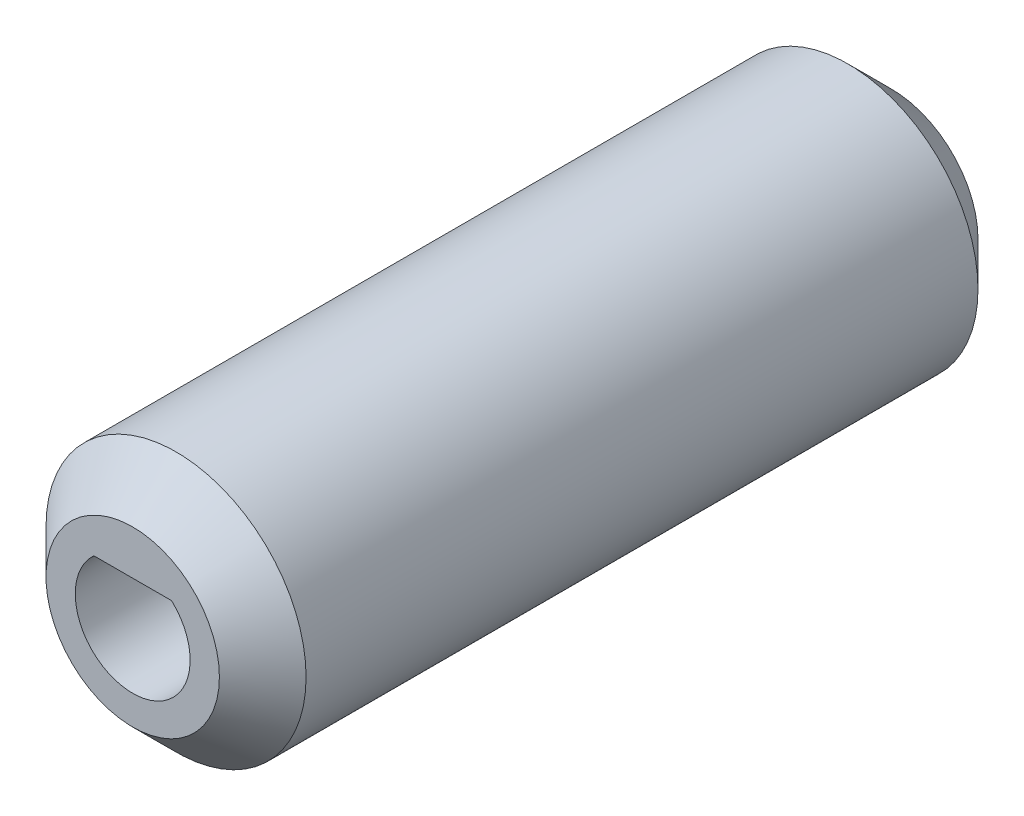
ISO-10303-21;
HEADER;
FILE_DESCRIPTION(('STEP AP214'),'2;1');
FILE_NAME('part.step','',(''),(''),'','','');
FILE_SCHEMA(('AUTOMOTIVE_DESIGN { 1 0 10303 214 1 1 1 1 }'));
ENDSEC;
DATA;
#1=APPLICATION_CONTEXT('core data for automotive mechanical design processes');
#2=APPLICATION_PROTOCOL_DEFINITION('international standard','automotive_design',2000,#1);
#3=PRODUCT_CONTEXT('',#1,'mechanical');
#4=PRODUCT('Part','Part','',(#3));
#5=PRODUCT_RELATED_PRODUCT_CATEGORY('part','',(#4));
#6=PRODUCT_DEFINITION_FORMATION('','',#4);
#7=PRODUCT_DEFINITION_CONTEXT('part definition',#1,'design');
#8=PRODUCT_DEFINITION('design','',#6,#7);
#9=PRODUCT_DEFINITION_SHAPE('','',#8);
#10=(LENGTH_UNIT() NAMED_UNIT(*) SI_UNIT(.MILLI.,.METRE.));
#11=(NAMED_UNIT(*) PLANE_ANGLE_UNIT() SI_UNIT($,.RADIAN.));
#12=(NAMED_UNIT(*) SI_UNIT($,.STERADIAN.) SOLID_ANGLE_UNIT());
#13=UNCERTAINTY_MEASURE_WITH_UNIT(LENGTH_MEASURE(1.E-05),#10,'distance_accuracy_value','');
#14=(GEOMETRIC_REPRESENTATION_CONTEXT(3) GLOBAL_UNCERTAINTY_ASSIGNED_CONTEXT((#13)) GLOBAL_UNIT_ASSIGNED_CONTEXT((#10,
#11,#12)) REPRESENTATION_CONTEXT('',''));
#15=CARTESIAN_POINT('',(0.,0.,0.));
#16=DIRECTION('',(0.,0.,1.));
#17=DIRECTION('',(1.,0.,0.));
#18=AXIS2_PLACEMENT_3D('',#15,#16,#17);
#19=CARTESIAN_POINT('',(0.,0.,35.));
#20=DIRECTION('',(0.,0.,1.));
#21=DIRECTION('',(1.,0.,0.));
#22=AXIS2_PLACEMENT_3D('',#19,#20,#21);
#23=PLANE('',#22);
#24=CARTESIAN_POINT('',(0.,0.,35.));
#25=DIRECTION('',(0.,0.,1.));
#26=DIRECTION('',(1.,0.,0.));
#27=AXIS2_PLACEMENT_3D('',#24,#25,#26);
#28=CIRCLE('',#27,4.);
#29=CARTESIAN_POINT('',(4.,0.,35.));
#30=VERTEX_POINT('',#29);
#31=EDGE_CURVE('E11',#30,#30,#28,.T.);
#32=ORIENTED_EDGE('',*,*,#31,.T.);
#33=EDGE_LOOP('',(#32));
#34=FACE_BOUND('',#33,.T.);
#35=CARTESIAN_POINT('',(0.,0.,35.));
#36=DIRECTION('',(0.,0.,1.));
#37=DIRECTION('',(1.,0.,0.));
#38=AXIS2_PLACEMENT_3D('',#35,#36,#37);
#39=CIRCLE('',#38,2.65);
#40=CARTESIAN_POINT('',(-1.79443584449264,1.95,35.));
#41=VERTEX_POINT('',#40);
#42=CARTESIAN_POINT('',(1.79443584449264,1.95,35.));
#43=VERTEX_POINT('',#42);
#44=EDGE_CURVE('E77',#41,#43,#39,.T.);
#45=ORIENTED_EDGE('',*,*,#44,.F.);
#46=DIRECTION('',(1.,0.,0.));
#47=VECTOR('',#46,1.);
#48=CARTESIAN_POINT('',(0.,1.95,35.));
#49=LINE('',#48,#47);
#50=EDGE_CURVE('E67',#41,#43,#49,.T.);
#51=ORIENTED_EDGE('',*,*,#50,.T.);
#52=EDGE_LOOP('',(#45,#51));
#53=FACE_BOUND('',#52,.T.);
#54=ADVANCED_FACE('F41',(#34,#53),#23,.T.);
#55=CARTESIAN_POINT('',(0.,0.,0.));
#56=DIRECTION('',(0.,0.,1.));
#57=DIRECTION('',(1.,0.,0.));
#58=AXIS2_PLACEMENT_3D('',#55,#56,#57);
#59=PLANE('',#58);
#60=CARTESIAN_POINT('',(0.,0.,0.));
#61=DIRECTION('',(0.,0.,1.));
#62=DIRECTION('',(1.,0.,0.));
#63=AXIS2_PLACEMENT_3D('',#60,#61,#62);
#64=CIRCLE('',#63,3.99999999999999);
#65=CARTESIAN_POINT('',(3.99999999999999,0.,0.));
#66=VERTEX_POINT('',#65);
#67=EDGE_CURVE('E50',#66,#66,#64,.F.);
#68=ORIENTED_EDGE('',*,*,#67,.T.);
#69=EDGE_LOOP('',(#68));
#70=FACE_BOUND('',#69,.T.);
#71=CARTESIAN_POINT('',(0.,0.,0.));
#72=DIRECTION('',(0.,0.,1.));
#73=DIRECTION('',(1.,0.,0.));
#74=AXIS2_PLACEMENT_3D('',#71,#72,#73);
#75=CIRCLE('',#74,2.65);
#76=CARTESIAN_POINT('',(-1.79443584449264,1.95,0.));
#77=VERTEX_POINT('',#76);
#78=CARTESIAN_POINT('',(1.79443584449264,1.95,0.));
#79=VERTEX_POINT('',#78);
#80=EDGE_CURVE('E79',#77,#79,#75,.T.);
#81=ORIENTED_EDGE('',*,*,#80,.T.);
#82=DIRECTION('',(-1.,0.,0.));
#83=VECTOR('',#82,1.);
#84=CARTESIAN_POINT('',(0.,1.95,0.));
#85=LINE('',#84,#83);
#86=EDGE_CURVE('E61',#79,#77,#85,.T.);
#87=ORIENTED_EDGE('',*,*,#86,.T.);
#88=EDGE_LOOP('',(#81,#87));
#89=FACE_BOUND('',#88,.T.);
#90=ADVANCED_FACE('F93',(#70,#89),#59,.F.);
#91=CARTESIAN_POINT('',(0.,0.,35.));
#92=DIRECTION('',(0.,0.,-1.));
#93=DIRECTION('',(-1.,0.,0.));
#94=AXIS2_PLACEMENT_3D('',#91,#92,#93);
#95=CYLINDRICAL_SURFACE('',#94,6.);
#96=CARTESIAN_POINT('',(0.,0.,2.));
#97=DIRECTION('',(0.,0.,1.));
#98=DIRECTION('',(1.,0.,0.));
#99=AXIS2_PLACEMENT_3D('',#96,#97,#98);
#100=CIRCLE('',#99,6.);
#101=CARTESIAN_POINT('',(6.,0.,2.));
#102=VERTEX_POINT('',#101);
#103=EDGE_CURVE('E84',#102,#102,#100,.T.);
#104=ORIENTED_EDGE('',*,*,#103,.T.);
#105=EDGE_LOOP('',(#104));
#106=FACE_BOUND('',#105,.T.);
#107=CARTESIAN_POINT('',(0.,0.,33.));
#108=DIRECTION('',(0.,0.,1.));
#109=DIRECTION('',(1.,0.,0.));
#110=AXIS2_PLACEMENT_3D('',#107,#108,#109);
#111=CIRCLE('',#110,6.);
#112=CARTESIAN_POINT('',(6.,0.,33.));
#113=VERTEX_POINT('',#112);
#114=EDGE_CURVE('E81',#113,#113,#111,.F.);
#115=ORIENTED_EDGE('',*,*,#114,.T.);
#116=EDGE_LOOP('',(#115));
#117=FACE_BOUND('',#116,.T.);
#118=ADVANCED_FACE('F101',(#106,#117),#95,.T.);
#119=CARTESIAN_POINT('',(0.,0.,35.));
#120=DIRECTION('',(0.,0.,-1.));
#121=DIRECTION('',(-1.,0.,0.));
#122=AXIS2_PLACEMENT_3D('',#119,#120,#121);
#123=CYLINDRICAL_SURFACE('',#122,2.65);
#124=DIRECTION('',(0.,0.,1.));
#125=VECTOR('',#124,1.);
#126=CARTESIAN_POINT('',(-1.79443584449264,1.95,-3.65650105975644));
#127=LINE('',#126,#125);
#128=EDGE_CURVE('E57',#77,#41,#127,.T.);
#129=ORIENTED_EDGE('',*,*,#128,.T.);
#130=ORIENTED_EDGE('',*,*,#44,.T.);
#131=DIRECTION('',(0.,0.,1.));
#132=VECTOR('',#131,1.);
#133=CARTESIAN_POINT('',(1.79443584449264,1.95,-3.65650105975644));
#134=LINE('',#133,#132);
#135=EDGE_CURVE('E69',#79,#43,#134,.T.);
#136=ORIENTED_EDGE('',*,*,#135,.F.);
#137=ORIENTED_EDGE('',*,*,#80,.F.);
#138=EDGE_LOOP('',(#129,#130,#136,#137));
#139=FACE_BOUND('',#138,.T.);
#140=ADVANCED_FACE('F76',(#139),#123,.F.);
#141=CARTESIAN_POINT('',(0.,1.95,-3.65650105975644));
#142=DIRECTION('',(0.,-1.,0.));
#143=DIRECTION('',(0.,0.,-1.));
#144=AXIS2_PLACEMENT_3D('',#141,#142,#143);
#145=PLANE('',#144);
#146=ORIENTED_EDGE('',*,*,#86,.F.);
#147=ORIENTED_EDGE('',*,*,#135,.T.);
#148=ORIENTED_EDGE('',*,*,#50,.F.);
#149=ORIENTED_EDGE('',*,*,#128,.F.);
#150=EDGE_LOOP('',(#146,#147,#148,#149));
#151=FACE_BOUND('',#150,.T.);
#152=ADVANCED_FACE('F68',(#151),#145,.T.);
#153=CARTESIAN_POINT('',(0.,0.,2.));
#154=DIRECTION('',(0.,0.,1.));
#155=DIRECTION('',(1.,0.,0.));
#156=AXIS2_PLACEMENT_3D('',#153,#154,#155);
#157=CONICAL_SURFACE('',#156,6.,0.78539816339745);
#158=ORIENTED_EDGE('',*,*,#67,.F.);
#159=EDGE_LOOP('',(#158));
#160=FACE_BOUND('',#159,.T.);
#161=ORIENTED_EDGE('',*,*,#103,.F.);
#162=EDGE_LOOP('',(#161));
#163=FACE_BOUND('',#162,.T.);
#164=ADVANCED_FACE('F96',(#160,#163),#157,.T.);
#165=CARTESIAN_POINT('',(0.,0.,35.));
#166=DIRECTION('',(0.,0.,-1.));
#167=DIRECTION('',(-1.,0.,0.));
#168=AXIS2_PLACEMENT_3D('',#165,#166,#167);
#169=CONICAL_SURFACE('',#168,4.,0.785398163397445);
#170=ORIENTED_EDGE('',*,*,#114,.F.);
#171=EDGE_LOOP('',(#170));
#172=FACE_BOUND('',#171,.T.);
#173=ORIENTED_EDGE('',*,*,#31,.F.);
#174=EDGE_LOOP('',(#173));
#175=FACE_BOUND('',#174,.T.);
#176=ADVANCED_FACE('F44',(#172,#175),#169,.T.);
#177=CLOSED_SHELL('',(#54,#90,#118,#140,#152,#164,#176));
#178=MANIFOLD_SOLID_BREP('B2',#177);
#179=ADVANCED_BREP_SHAPE_REPRESENTATION('',(#18,#178),#14);
#180=SHAPE_DEFINITION_REPRESENTATION(#9,#179);
ENDSEC;
END-ISO-10303-21;
